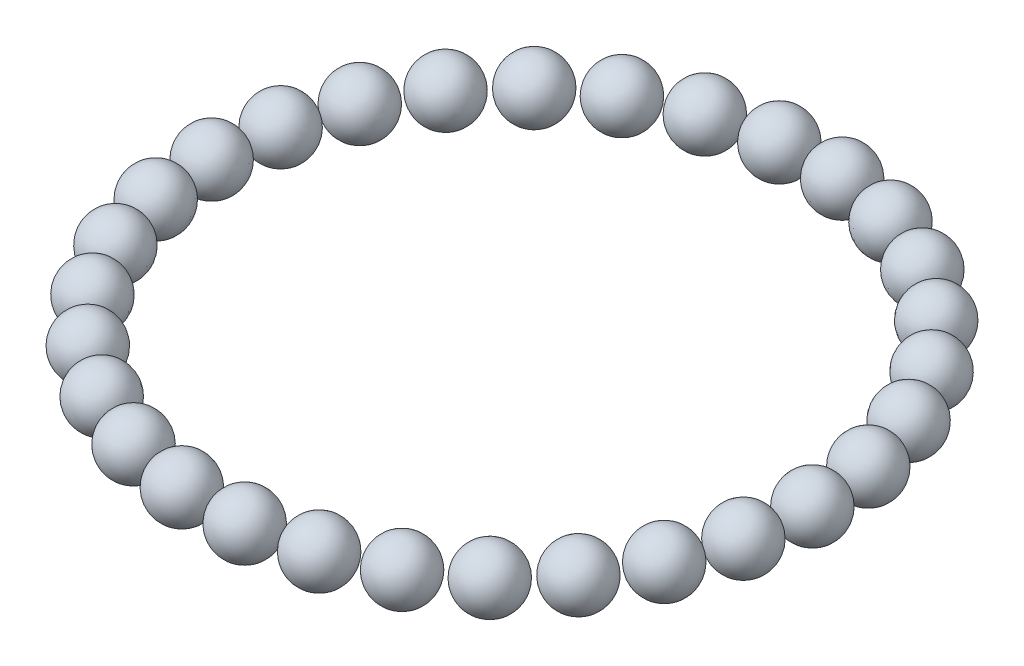
ISO-10303-21;
HEADER;
FILE_DESCRIPTION(('STEP AP214'),'2;1');
FILE_NAME('part.step','',(''),(''),'','','');
FILE_SCHEMA(('AUTOMOTIVE_DESIGN { 1 0 10303 214 1 1 1 1 }'));
ENDSEC;
DATA;
#1=APPLICATION_CONTEXT('core data for automotive mechanical design processes');
#2=APPLICATION_PROTOCOL_DEFINITION('international standard','automotive_design',2000,#1);
#3=PRODUCT_CONTEXT('',#1,'mechanical');
#4=PRODUCT('Part','Part','',(#3));
#5=PRODUCT_RELATED_PRODUCT_CATEGORY('part','',(#4));
#6=PRODUCT_DEFINITION_FORMATION('','',#4);
#7=PRODUCT_DEFINITION_CONTEXT('part definition',#1,'design');
#8=PRODUCT_DEFINITION('design','',#6,#7);
#9=PRODUCT_DEFINITION_SHAPE('','',#8);
#10=(LENGTH_UNIT() NAMED_UNIT(*) SI_UNIT(.MILLI.,.METRE.));
#11=(NAMED_UNIT(*) PLANE_ANGLE_UNIT() SI_UNIT($,.RADIAN.));
#12=(NAMED_UNIT(*) SI_UNIT($,.STERADIAN.) SOLID_ANGLE_UNIT());
#13=UNCERTAINTY_MEASURE_WITH_UNIT(LENGTH_MEASURE(1.E-05),#10,'distance_accuracy_value','');
#14=(GEOMETRIC_REPRESENTATION_CONTEXT(3) GLOBAL_UNCERTAINTY_ASSIGNED_CONTEXT((#13)) GLOBAL_UNIT_ASSIGNED_CONTEXT((#10,
#11,#12)) REPRESENTATION_CONTEXT('',''));
#15=CARTESIAN_POINT('',(0.,0.,0.));
#16=DIRECTION('',(0.,0.,1.));
#17=DIRECTION('',(1.,0.,0.));
#18=AXIS2_PLACEMENT_3D('',#15,#16,#17);
#19=CARTESIAN_POINT('',(0.277525470680636,0.,2.64047847338538));
#20=DIRECTION('',(0.,1.,0.));
#21=DIRECTION('',(0.978147600733808,0.,-0.207911690817747));
#22=AXIS2_PLACEMENT_3D('',#19,#20,#21);
#23=SPHERICAL_SURFACE('',#22,1.25);
#24=CARTESIAN_POINT('',(0.277525470680636,1.25,2.64047847338538));
#25=VERTEX_POINT('',#24);
#26=VERTEX_LOOP('',#25);
#27=FACE_BOUND('',#26,.T.);
#28=ADVANCED_FACE('F44',(#27),#23,.T.);
#29=CLOSED_SHELL('',(#28));
#30=MANIFOLD_SOLID_BREP('B2',#29);
#31=CARTESIAN_POINT('',(1.0979726879389,0.,5.16555536706252));
#32=DIRECTION('',(0.,1.,0.));
#33=DIRECTION('',(0.913545457642606,0.,-0.406736643075789));
#34=AXIS2_PLACEMENT_3D('',#31,#32,#33);
#35=SPHERICAL_SURFACE('',#34,1.25);
#36=CARTESIAN_POINT('',(1.0979726879389,1.25,5.16555536706252));
#37=VERTEX_POINT('',#36);
#38=VERTEX_LOOP('',#37);
#39=FACE_BOUND('',#38,.T.);
#40=ADVANCED_FACE('F65',(#39),#35,.T.);
#41=CLOSED_SHELL('',(#40));
#42=MANIFOLD_SOLID_BREP('B6',#41);
#43=CARTESIAN_POINT('',(2.42548417143808,0.,7.46487270411428));
#44=DIRECTION('',(0.,1.,0.));
#45=DIRECTION('',(0.809016994374955,0.,-0.587785252292463));
#46=AXIS2_PLACEMENT_3D('',#43,#44,#45);
#47=SPHERICAL_SURFACE('',#46,1.25);
#48=CARTESIAN_POINT('',(2.42548417143808,1.25,7.46487270411428));
#49=VERTEX_POINT('',#48);
#50=VERTEX_LOOP('',#49);
#51=FACE_BOUND('',#50,.T.);
#52=ADVANCED_FACE('F86',(#51),#47,.T.);
#53=CLOSED_SHELL('',(#52));
#54=MANIFOLD_SOLID_BREP('B40',#53);
#55=CARTESIAN_POINT('',(4.20204129924239,0.,9.43793928356281));
#56=DIRECTION('',(0.,1.,0.));
#57=DIRECTION('',(0.669130606358867,0.,-0.743144825477386));
#58=AXIS2_PLACEMENT_3D('',#55,#56,#57);
#59=SPHERICAL_SURFACE('',#58,1.25);
#60=CARTESIAN_POINT('',(4.20204129924239,1.25,9.43793928356281));
#61=VERTEX_POINT('',#60);
#62=VERTEX_LOOP('',#61);
#63=FACE_BOUND('',#62,.T.);
#64=ADVANCED_FACE('F107',(#63),#59,.T.);
#65=CLOSED_SHELL('',(#64));
#66=MANIFOLD_SOLID_BREP('B61',#65);
#67=CARTESIAN_POINT('',(6.34999999999987,0.,10.9985226280623));
#68=DIRECTION('',(0.,1.,0.));
#69=DIRECTION('',(0.50000000000001,0.,-0.866025403784433));
#70=AXIS2_PLACEMENT_3D('',#67,#68,#69);
#71=SPHERICAL_SURFACE('',#70,1.25);
#72=CARTESIAN_POINT('',(6.34999999999987,1.25,10.9985226280623));
#73=VERTEX_POINT('',#72);
#74=VERTEX_LOOP('',#73);
#75=FACE_BOUND('',#74,.T.);
#76=ADVANCED_FACE('F128',(#75),#71,.T.);
#77=CLOSED_SHELL('',(#76));
#78=MANIFOLD_SOLID_BREP('B82',#77);
#79=CARTESIAN_POINT('',(8.77548417143804,0.,12.0784177569484));
#80=DIRECTION('',(0.,1.,0.));
#81=DIRECTION('',(0.309016994374957,0.,-0.95105651629515));
#82=AXIS2_PLACEMENT_3D('',#79,#80,#81);
#83=SPHERICAL_SURFACE('',#82,1.25);
#84=CARTESIAN_POINT('',(8.77548417143804,1.25,12.0784177569484));
#85=VERTEX_POINT('',#84);
#86=VERTEX_LOOP('',#85);
#87=FACE_BOUND('',#86,.T.);
#88=ADVANCED_FACE('F149',(#87),#83,.T.);
#89=CLOSED_SHELL('',(#88));
#90=MANIFOLD_SOLID_BREP('B103',#89);
#91=CARTESIAN_POINT('',(11.3724885165007,0.,12.6304280711771));
#92=DIRECTION('',(0.,1.,0.));
#93=DIRECTION('',(0.104528463267664,0.,-0.994521895368272));
#94=AXIS2_PLACEMENT_3D('',#91,#92,#93);
#95=SPHERICAL_SURFACE('',#94,1.25);
#96=CARTESIAN_POINT('',(11.3724885165007,1.25,12.6304280711771));
#97=VERTEX_POINT('',#96);
#98=VERTEX_LOOP('',#97);
#99=FACE_BOUND('',#98,.T.);
#100=ADVANCED_FACE('F170',(#99),#95,.T.);
#101=CLOSED_SHELL('',(#100));
#102=MANIFOLD_SOLID_BREP('B124',#101);
#103=CARTESIAN_POINT('',(14.0275114834991,0.,12.6304280711771));
#104=DIRECTION('',(0.,1.,0.));
#105=DIRECTION('',(-0.104528463267644,0.,-0.994521895368274));
#106=AXIS2_PLACEMENT_3D('',#103,#104,#105);
#107=SPHERICAL_SURFACE('',#106,1.25);
#108=CARTESIAN_POINT('',(14.0275114834991,1.25,12.6304280711771));
#109=VERTEX_POINT('',#108);
#110=VERTEX_LOOP('',#109);
#111=FACE_BOUND('',#110,.T.);
#112=ADVANCED_FACE('F191',(#111),#107,.T.);
#113=CLOSED_SHELL('',(#112));
#114=MANIFOLD_SOLID_BREP('B145',#113);
#115=CARTESIAN_POINT('',(16.6245158285617,0.,12.0784177569485));
#116=DIRECTION('',(0.,1.,0.));
#117=DIRECTION('',(-0.309016994374938,0.,-0.951056516295157));
#118=AXIS2_PLACEMENT_3D('',#115,#116,#117);
#119=SPHERICAL_SURFACE('',#118,1.25);
#120=CARTESIAN_POINT('',(16.6245158285617,1.25,12.0784177569485));
#121=VERTEX_POINT('',#120);
#122=VERTEX_LOOP('',#121);
#123=FACE_BOUND('',#122,.T.);
#124=ADVANCED_FACE('F212',(#123),#119,.T.);
#125=CLOSED_SHELL('',(#124));
#126=MANIFOLD_SOLID_BREP('B166',#125);
#127=CARTESIAN_POINT('',(19.0499999999999,0.,10.9985226280624));
#128=DIRECTION('',(0.,1.,0.));
#129=DIRECTION('',(-0.499999999999992,0.,-0.866025403784443));
#130=AXIS2_PLACEMENT_3D('',#127,#128,#129);
#131=SPHERICAL_SURFACE('',#130,1.25);
#132=CARTESIAN_POINT('',(19.0499999999999,1.25,10.9985226280624));
#133=VERTEX_POINT('',#132);
#134=VERTEX_LOOP('',#133);
#135=FACE_BOUND('',#134,.T.);
#136=ADVANCED_FACE('F233',(#135),#131,.T.);
#137=CLOSED_SHELL('',(#136));
#138=MANIFOLD_SOLID_BREP('B187',#137);
#139=CARTESIAN_POINT('',(21.1979587007574,0.,9.43793928356298));
#140=DIRECTION('',(0.,1.,0.));
#141=DIRECTION('',(-0.669130606358852,0.,-0.7431448254774));
#142=AXIS2_PLACEMENT_3D('',#139,#140,#141);
#143=SPHERICAL_SURFACE('',#142,1.25);
#144=CARTESIAN_POINT('',(21.1979587007574,1.25,9.43793928356298));
#145=VERTEX_POINT('',#144);
#146=VERTEX_LOOP('',#145);
#147=FACE_BOUND('',#146,.T.);
#148=ADVANCED_FACE('F254',(#147),#143,.T.);
#149=CLOSED_SHELL('',(#148));
#150=MANIFOLD_SOLID_BREP('B208',#149);
#151=CARTESIAN_POINT('',(22.9745158285618,0.,7.46487270411449));
#152=DIRECTION('',(0.,1.,0.));
#153=DIRECTION('',(-0.809016994374943,0.,-0.58778525229248));
#154=AXIS2_PLACEMENT_3D('',#151,#152,#153);
#155=SPHERICAL_SURFACE('',#154,1.25);
#156=CARTESIAN_POINT('',(22.9745158285618,1.25,7.46487270411449));
#157=VERTEX_POINT('',#156);
#158=VERTEX_LOOP('',#157);
#159=FACE_BOUND('',#158,.T.);
#160=ADVANCED_FACE('F275',(#159),#155,.T.);
#161=CLOSED_SHELL('',(#160));
#162=MANIFOLD_SOLID_BREP('B229',#161);
#163=CARTESIAN_POINT('',(24.302027312061,0.,5.16555536706275));
#164=DIRECTION('',(0.,1.,0.));
#165=DIRECTION('',(-0.913545457642598,0.,-0.406736643075807));
#166=AXIS2_PLACEMENT_3D('',#163,#164,#165);
#167=SPHERICAL_SURFACE('',#166,1.25);
#168=CARTESIAN_POINT('',(24.302027312061,1.25,5.16555536706275));
#169=VERTEX_POINT('',#168);
#170=VERTEX_LOOP('',#169);
#171=FACE_BOUND('',#170,.T.);
#172=ADVANCED_FACE('F296',(#171),#167,.T.);
#173=CLOSED_SHELL('',(#172));
#174=MANIFOLD_SOLID_BREP('B250',#173);
#175=CARTESIAN_POINT('',(25.1224745293193,0.,2.64047847338563));
#176=DIRECTION('',(0.,1.,0.));
#177=DIRECTION('',(-0.978147600733804,0.,-0.207911690817766));
#178=AXIS2_PLACEMENT_3D('',#175,#176,#177);
#179=SPHERICAL_SURFACE('',#178,1.25);
#180=CARTESIAN_POINT('',(25.1224745293193,1.25,2.64047847338563));
#181=VERTEX_POINT('',#180);
#182=VERTEX_LOOP('',#181);
#183=FACE_BOUND('',#182,.T.);
#184=ADVANCED_FACE('F317',(#183),#179,.T.);
#185=CLOSED_SHELL('',(#184));
#186=MANIFOLD_SOLID_BREP('B271',#185);
#187=CARTESIAN_POINT('',(25.4,0.,0.));
#188=DIRECTION('',(0.,1.,0.));
#189=DIRECTION('',(-1.,0.,0.));
#190=AXIS2_PLACEMENT_3D('',#187,#188,#189);
#191=SPHERICAL_SURFACE('',#190,1.25);
#192=CARTESIAN_POINT('',(25.4,1.25,0.));
#193=VERTEX_POINT('',#192);
#194=VERTEX_LOOP('',#193);
#195=FACE_BOUND('',#194,.T.);
#196=ADVANCED_FACE('F338',(#195),#191,.T.);
#197=CLOSED_SHELL('',(#196));
#198=MANIFOLD_SOLID_BREP('B292',#197);
#199=CARTESIAN_POINT('',(25.1224745293193,0.,-2.64047847338547));
#200=DIRECTION('',(0.,1.,0.));
#201=DIRECTION('',(-0.978147600733807,0.,0.207911690817753));
#202=AXIS2_PLACEMENT_3D('',#199,#200,#201);
#203=SPHERICAL_SURFACE('',#202,1.25);
#204=CARTESIAN_POINT('',(25.1224745293193,1.25,-2.64047847338547));
#205=VERTEX_POINT('',#204);
#206=VERTEX_LOOP('',#205);
#207=FACE_BOUND('',#206,.T.);
#208=ADVANCED_FACE('F359',(#207),#203,.T.);
#209=CLOSED_SHELL('',(#208));
#210=MANIFOLD_SOLID_BREP('B313',#209);
#211=CARTESIAN_POINT('',(24.3020273120611,0.,-5.16555536706259));
#212=DIRECTION('',(0.,1.,0.));
#213=DIRECTION('',(-0.913545457642603,0.,0.406736643075795));
#214=AXIS2_PLACEMENT_3D('',#211,#212,#213);
#215=SPHERICAL_SURFACE('',#214,1.25);
#216=CARTESIAN_POINT('',(24.3020273120611,1.25,-5.16555536706259));
#217=VERTEX_POINT('',#216);
#218=VERTEX_LOOP('',#217);
#219=FACE_BOUND('',#218,.T.);
#220=ADVANCED_FACE('F380',(#219),#215,.T.);
#221=CLOSED_SHELL('',(#220));
#222=MANIFOLD_SOLID_BREP('B334',#221);
#223=CARTESIAN_POINT('',(22.9745158285619,0.,-7.46487270411435));
#224=DIRECTION('',(0.,1.,0.));
#225=DIRECTION('',(-0.80901699437495,0.,0.587785252292469));
#226=AXIS2_PLACEMENT_3D('',#223,#224,#225);
#227=SPHERICAL_SURFACE('',#226,1.25);
#228=CARTESIAN_POINT('',(22.9745158285619,1.25,-7.46487270411435));
#229=VERTEX_POINT('',#228);
#230=VERTEX_LOOP('',#229);
#231=FACE_BOUND('',#230,.T.);
#232=ADVANCED_FACE('F401',(#231),#227,.T.);
#233=CLOSED_SHELL('',(#232));
#234=MANIFOLD_SOLID_BREP('B355',#233);
#235=CARTESIAN_POINT('',(21.1979587007575,0.,-9.43793928356286));
#236=DIRECTION('',(0.,1.,0.));
#237=DIRECTION('',(-0.669130606358862,0.,0.743144825477391));
#238=AXIS2_PLACEMENT_3D('',#235,#236,#237);
#239=SPHERICAL_SURFACE('',#238,1.25);
#240=CARTESIAN_POINT('',(21.1979587007575,1.25,-9.43793928356286));
#241=VERTEX_POINT('',#240);
#242=VERTEX_LOOP('',#241);
#243=FACE_BOUND('',#242,.T.);
#244=ADVANCED_FACE('F422',(#243),#239,.T.);
#245=CLOSED_SHELL('',(#244));
#246=MANIFOLD_SOLID_BREP('B376',#245);
#247=CARTESIAN_POINT('',(19.0500000000001,0.,-10.9985226280623));
#248=DIRECTION('',(0.,1.,0.));
#249=DIRECTION('',(-0.500000000000004,0.,0.866025403784436));
#250=AXIS2_PLACEMENT_3D('',#247,#248,#249);
#251=SPHERICAL_SURFACE('',#250,1.25);
#252=CARTESIAN_POINT('',(19.0500000000001,1.25,-10.9985226280623));
#253=VERTEX_POINT('',#252);
#254=VERTEX_LOOP('',#253);
#255=FACE_BOUND('',#254,.T.);
#256=ADVANCED_FACE('F443',(#255),#251,.T.);
#257=CLOSED_SHELL('',(#256));
#258=MANIFOLD_SOLID_BREP('B397',#257);
#259=CARTESIAN_POINT('',(16.6245158285619,0.,-12.0784177569484));
#260=DIRECTION('',(0.,1.,0.));
#261=DIRECTION('',(-0.309016994374951,0.,0.951056516295152));
#262=AXIS2_PLACEMENT_3D('',#259,#260,#261);
#263=SPHERICAL_SURFACE('',#262,1.25);
#264=CARTESIAN_POINT('',(16.6245158285619,1.25,-12.0784177569484));
#265=VERTEX_POINT('',#264);
#266=VERTEX_LOOP('',#265);
#267=FACE_BOUND('',#266,.T.);
#268=ADVANCED_FACE('F464',(#267),#263,.T.);
#269=CLOSED_SHELL('',(#268));
#270=MANIFOLD_SOLID_BREP('B418',#269);
#271=CARTESIAN_POINT('',(14.0275114834992,0.,-12.6304280711771));
#272=DIRECTION('',(0.,1.,0.));
#273=DIRECTION('',(-0.104528463267657,0.,0.994521895368273));
#274=AXIS2_PLACEMENT_3D('',#271,#272,#273);
#275=SPHERICAL_SURFACE('',#274,1.25);
#276=CARTESIAN_POINT('',(14.0275114834992,1.25,-12.6304280711771));
#277=VERTEX_POINT('',#276);
#278=VERTEX_LOOP('',#277);
#279=FACE_BOUND('',#278,.T.);
#280=ADVANCED_FACE('F485',(#279),#275,.T.);
#281=CLOSED_SHELL('',(#280));
#282=MANIFOLD_SOLID_BREP('B439',#281);
#283=CARTESIAN_POINT('',(11.3724885165008,0.,-12.6304280711771));
#284=DIRECTION('',(0.,1.,0.));
#285=DIRECTION('',(0.10452846326765,0.,0.994521895368274));
#286=AXIS2_PLACEMENT_3D('',#283,#284,#285);
#287=SPHERICAL_SURFACE('',#286,1.25);
#288=CARTESIAN_POINT('',(11.3724885165008,1.25,-12.6304280711771));
#289=VERTEX_POINT('',#288);
#290=VERTEX_LOOP('',#289);
#291=FACE_BOUND('',#290,.T.);
#292=ADVANCED_FACE('F506',(#291),#287,.T.);
#293=CLOSED_SHELL('',(#292));
#294=MANIFOLD_SOLID_BREP('B460',#293);
#295=CARTESIAN_POINT('',(8.7754841714382,0.,-12.0784177569485));
#296=DIRECTION('',(0.,1.,0.));
#297=DIRECTION('',(0.309016994374945,0.,0.951056516295154));
#298=AXIS2_PLACEMENT_3D('',#295,#296,#297);
#299=SPHERICAL_SURFACE('',#298,1.25);
#300=CARTESIAN_POINT('',(8.7754841714382,1.25,-12.0784177569485));
#301=VERTEX_POINT('',#300);
#302=VERTEX_LOOP('',#301);
#303=FACE_BOUND('',#302,.T.);
#304=ADVANCED_FACE('F527',(#303),#299,.T.);
#305=CLOSED_SHELL('',(#304));
#306=MANIFOLD_SOLID_BREP('B481',#305);
#307=CARTESIAN_POINT('',(6.35000000000002,0.,-10.9985226280624));
#308=DIRECTION('',(0.,1.,0.));
#309=DIRECTION('',(0.499999999999998,0.,0.86602540378444));
#310=AXIS2_PLACEMENT_3D('',#307,#308,#309);
#311=SPHERICAL_SURFACE('',#310,1.25);
#312=CARTESIAN_POINT('',(6.35000000000002,1.25,-10.9985226280624));
#313=VERTEX_POINT('',#312);
#314=VERTEX_LOOP('',#313);
#315=FACE_BOUND('',#314,.T.);
#316=ADVANCED_FACE('F548',(#315),#311,.T.);
#317=CLOSED_SHELL('',(#316));
#318=MANIFOLD_SOLID_BREP('B502',#317);
#319=CARTESIAN_POINT('',(4.20204129924252,0.,-9.43793928356292));
#320=DIRECTION('',(0.,1.,0.));
#321=DIRECTION('',(0.669130606358857,0.,0.743144825477395));
#322=AXIS2_PLACEMENT_3D('',#319,#320,#321);
#323=SPHERICAL_SURFACE('',#322,1.25);
#324=CARTESIAN_POINT('',(4.20204129924252,1.25,-9.43793928356292));
#325=VERTEX_POINT('',#324);
#326=VERTEX_LOOP('',#325);
#327=FACE_BOUND('',#326,.T.);
#328=ADVANCED_FACE('F569',(#327),#323,.T.);
#329=CLOSED_SHELL('',(#328));
#330=MANIFOLD_SOLID_BREP('B523',#329);
#331=CARTESIAN_POINT('',(2.42548417143818,0.,-7.46487270411442));
#332=DIRECTION('',(0.,1.,0.));
#333=DIRECTION('',(0.809016994374947,0.,0.587785252292474));
#334=AXIS2_PLACEMENT_3D('',#331,#332,#333);
#335=SPHERICAL_SURFACE('',#334,1.25);
#336=CARTESIAN_POINT('',(2.42548417143818,1.25,-7.46487270411442));
#337=VERTEX_POINT('',#336);
#338=VERTEX_LOOP('',#337);
#339=FACE_BOUND('',#338,.T.);
#340=ADVANCED_FACE('F590',(#339),#335,.T.);
#341=CLOSED_SHELL('',(#340));
#342=MANIFOLD_SOLID_BREP('B544',#341);
#343=CARTESIAN_POINT('',(1.09797268793897,0.,-5.16555536706267));
#344=DIRECTION('',(0.,1.,0.));
#345=DIRECTION('',(0.913545457642601,0.,0.406736643075801));
#346=AXIS2_PLACEMENT_3D('',#343,#344,#345);
#347=SPHERICAL_SURFACE('',#346,1.25);
#348=CARTESIAN_POINT('',(1.09797268793897,1.25,-5.16555536706267));
#349=VERTEX_POINT('',#348);
#350=VERTEX_LOOP('',#349);
#351=FACE_BOUND('',#350,.T.);
#352=ADVANCED_FACE('F611',(#351),#347,.T.);
#353=CLOSED_SHELL('',(#352));
#354=MANIFOLD_SOLID_BREP('B565',#353);
#355=CARTESIAN_POINT('',(0.277525470680669,0.,-2.64047847338555));
#356=DIRECTION('',(0.,1.,0.));
#357=DIRECTION('',(0.978147600733806,0.,0.20791169081776));
#358=AXIS2_PLACEMENT_3D('',#355,#356,#357);
#359=SPHERICAL_SURFACE('',#358,1.25);
#360=CARTESIAN_POINT('',(0.277525470680669,1.25,-2.64047847338555));
#361=VERTEX_POINT('',#360);
#362=VERTEX_LOOP('',#361);
#363=FACE_BOUND('',#362,.T.);
#364=ADVANCED_FACE('F631',(#363),#359,.T.);
#365=CLOSED_SHELL('',(#364));
#366=MANIFOLD_SOLID_BREP('B586',#365);
#367=CARTESIAN_POINT('',(0.,0.,0.));
#368=DIRECTION('',(0.,1.,0.));
#369=DIRECTION('',(1.,0.,0.));
#370=AXIS2_PLACEMENT_3D('',#367,#368,#369);
#371=SPHERICAL_SURFACE('',#370,1.25);
#372=CARTESIAN_POINT('',(0.,1.25,0.));
#373=VERTEX_POINT('',#372);
#374=VERTEX_LOOP('',#373);
#375=FACE_BOUND('',#374,.T.);
#376=ADVANCED_FACE('F646',(#375),#371,.T.);
#377=CLOSED_SHELL('',(#376));
#378=MANIFOLD_SOLID_BREP('B607',#377);
#379=ADVANCED_BREP_SHAPE_REPRESENTATION('',(#18,#30,#42,#54,#66,#78,#90,#102,#114,#126,#138,
#150,#162,#174,#186,#198,#210,#222,#234,#246,#258,#270,#282,#294,#306,#318,#330,#342,#354,#366,
#378),#14);
#380=SHAPE_DEFINITION_REPRESENTATION(#9,#379);
ENDSEC;
END-ISO-10303-21;
